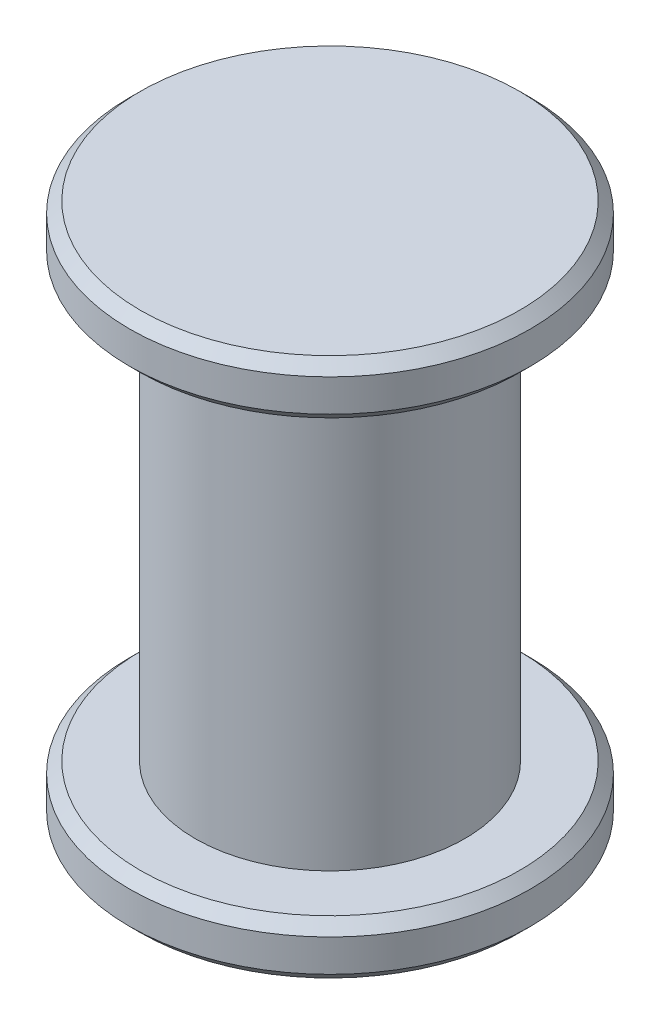
ISO-10303-21;
HEADER;
FILE_DESCRIPTION(('STEP AP214'),'2;1');
FILE_NAME('part.step','',(''),(''),'','','');
FILE_SCHEMA(('AUTOMOTIVE_DESIGN { 1 0 10303 214 1 1 1 1 }'));
ENDSEC;
DATA;
#1=APPLICATION_CONTEXT('core data for automotive mechanical design processes');
#2=APPLICATION_PROTOCOL_DEFINITION('international standard','automotive_design',2000,#1);
#3=PRODUCT_CONTEXT('',#1,'mechanical');
#4=PRODUCT('Part','Part','',(#3));
#5=PRODUCT_RELATED_PRODUCT_CATEGORY('part','',(#4));
#6=PRODUCT_DEFINITION_FORMATION('','',#4);
#7=PRODUCT_DEFINITION_CONTEXT('part definition',#1,'design');
#8=PRODUCT_DEFINITION('design','',#6,#7);
#9=PRODUCT_DEFINITION_SHAPE('','',#8);
#10=(LENGTH_UNIT() NAMED_UNIT(*) SI_UNIT(.MILLI.,.METRE.));
#11=(NAMED_UNIT(*) PLANE_ANGLE_UNIT() SI_UNIT($,.RADIAN.));
#12=(NAMED_UNIT(*) SI_UNIT($,.STERADIAN.) SOLID_ANGLE_UNIT());
#13=UNCERTAINTY_MEASURE_WITH_UNIT(LENGTH_MEASURE(1.E-05),#10,'distance_accuracy_value','');
#14=(GEOMETRIC_REPRESENTATION_CONTEXT(3) GLOBAL_UNCERTAINTY_ASSIGNED_CONTEXT((#13)) GLOBAL_UNIT_ASSIGNED_CONTEXT((#10,
#11,#12)) REPRESENTATION_CONTEXT('',''));
#15=CARTESIAN_POINT('',(0.,0.,0.));
#16=DIRECTION('',(0.,0.,1.));
#17=DIRECTION('',(1.,0.,0.));
#18=AXIS2_PLACEMENT_3D('',#15,#16,#17);
#19=CARTESIAN_POINT('',(0.,0.8,0.));
#20=DIRECTION('',(0.,-1.,0.));
#21=DIRECTION('',(0.,0.,-1.));
#22=AXIS2_PLACEMENT_3D('',#19,#20,#21);
#23=CYLINDRICAL_SURFACE('',#22,0.25);
#24=CARTESIAN_POINT('',(0.,0.8,0.));
#25=DIRECTION('',(0.,1.,0.));
#26=DIRECTION('',(0.,0.,1.));
#27=AXIS2_PLACEMENT_3D('',#24,#25,#26);
#28=CIRCLE('',#27,0.25);
#29=CARTESIAN_POINT('',(0.,0.8,0.25));
#30=VERTEX_POINT('',#29);
#31=EDGE_CURVE('E77',#30,#30,#28,.T.);
#32=ORIENTED_EDGE('',*,*,#31,.F.);
#33=EDGE_LOOP('',(#32));
#34=FACE_BOUND('',#33,.T.);
#35=CARTESIAN_POINT('',(0.,0.,0.));
#36=DIRECTION('',(0.,1.,0.));
#37=DIRECTION('',(0.,0.,1.));
#38=AXIS2_PLACEMENT_3D('',#35,#36,#37);
#39=CIRCLE('',#38,0.25);
#40=CARTESIAN_POINT('',(0.,0.,0.25));
#41=VERTEX_POINT('',#40);
#42=EDGE_CURVE('E78',#41,#41,#39,.T.);
#43=ORIENTED_EDGE('',*,*,#42,.T.);
#44=EDGE_LOOP('',(#43));
#45=FACE_BOUND('',#44,.T.);
#46=ADVANCED_FACE('F37',(#34,#45),#23,.T.);
#47=CARTESIAN_POINT('',(0.,0.9,0.));
#48=DIRECTION('',(0.,-1.,0.));
#49=DIRECTION('',(0.,0.,-1.));
#50=AXIS2_PLACEMENT_3D('',#47,#48,#49);
#51=CYLINDRICAL_SURFACE('',#50,0.371871199051348);
#52=CARTESIAN_POINT('',(0.,0.82,0.));
#53=DIRECTION('',(0.,1.,0.));
#54=DIRECTION('',(0.,0.,1.));
#55=AXIS2_PLACEMENT_3D('',#52,#53,#54);
#56=CIRCLE('',#55,0.371871199051348);
#57=CARTESIAN_POINT('',(0.,0.82,0.371871199051348));
#58=VERTEX_POINT('',#57);
#59=EDGE_CURVE('E55',#58,#58,#56,.T.);
#60=ORIENTED_EDGE('',*,*,#59,.T.);
#61=EDGE_LOOP('',(#60));
#62=FACE_BOUND('',#61,.T.);
#63=CARTESIAN_POINT('',(0.,0.88,0.));
#64=DIRECTION('',(0.,1.,0.));
#65=DIRECTION('',(0.,0.,1.));
#66=AXIS2_PLACEMENT_3D('',#63,#64,#65);
#67=CIRCLE('',#66,0.371871199051348);
#68=CARTESIAN_POINT('',(0.,0.88,0.371871199051348));
#69=VERTEX_POINT('',#68);
#70=EDGE_CURVE('E69',#69,#69,#67,.F.);
#71=ORIENTED_EDGE('',*,*,#70,.T.);
#72=EDGE_LOOP('',(#71));
#73=FACE_BOUND('',#72,.T.);
#74=ADVANCED_FACE('F90',(#62,#73),#51,.T.);
#75=CARTESIAN_POINT('',(0.,0.9,0.));
#76=DIRECTION('',(0.,1.,0.));
#77=DIRECTION('',(0.,0.,1.));
#78=AXIS2_PLACEMENT_3D('',#75,#76,#77);
#79=PLANE('',#78);
#80=CARTESIAN_POINT('',(0.,0.9,0.));
#81=DIRECTION('',(0.,1.,0.));
#82=DIRECTION('',(0.,0.,1.));
#83=AXIS2_PLACEMENT_3D('',#80,#81,#82);
#84=CIRCLE('',#83,0.351871199051348);
#85=CARTESIAN_POINT('',(0.,0.9,0.351871199051348));
#86=VERTEX_POINT('',#85);
#87=EDGE_CURVE('E73',#86,#86,#84,.T.);
#88=ORIENTED_EDGE('',*,*,#87,.T.);
#89=EDGE_LOOP('',(#88));
#90=FACE_BOUND('',#89,.T.);
#91=ADVANCED_FACE('F112',(#90),#79,.T.);
#92=CARTESIAN_POINT('',(0.,0.8,0.));
#93=DIRECTION('',(0.,1.,0.));
#94=DIRECTION('',(0.,0.,1.));
#95=AXIS2_PLACEMENT_3D('',#92,#93,#94);
#96=PLANE('',#95);
#97=CARTESIAN_POINT('',(0.,0.8,0.));
#98=DIRECTION('',(0.,1.,0.));
#99=DIRECTION('',(0.,0.,1.));
#100=AXIS2_PLACEMENT_3D('',#97,#98,#99);
#101=CIRCLE('',#100,0.351871199051348);
#102=CARTESIAN_POINT('',(0.,0.8,0.351871199051348));
#103=VERTEX_POINT('',#102);
#104=EDGE_CURVE('E50',#103,#103,#101,.F.);
#105=ORIENTED_EDGE('',*,*,#104,.T.);
#106=EDGE_LOOP('',(#105));
#107=FACE_BOUND('',#106,.T.);
#108=ORIENTED_EDGE('',*,*,#31,.T.);
#109=EDGE_LOOP('',(#108));
#110=FACE_BOUND('',#109,.T.);
#111=ADVANCED_FACE('F86',(#107,#110),#96,.F.);
#112=CARTESIAN_POINT('',(0.,-0.1,0.));
#113=DIRECTION('',(0.,1.,0.));
#114=DIRECTION('',(0.,0.,1.));
#115=AXIS2_PLACEMENT_3D('',#112,#113,#114);
#116=CYLINDRICAL_SURFACE('',#115,0.371871199051348);
#117=CARTESIAN_POINT('',(0.,-0.0799999999999998,0.));
#118=DIRECTION('',(0.,-1.,0.));
#119=DIRECTION('',(0.,0.,-1.));
#120=AXIS2_PLACEMENT_3D('',#117,#118,#119);
#121=CIRCLE('',#120,0.371871199051348);
#122=CARTESIAN_POINT('',(0.,-0.0799999999999998,-0.371871199051348));
#123=VERTEX_POINT('',#122);
#124=EDGE_CURVE('E10',#123,#123,#121,.F.);
#125=ORIENTED_EDGE('',*,*,#124,.T.);
#126=EDGE_LOOP('',(#125));
#127=FACE_BOUND('',#126,.T.);
#128=CARTESIAN_POINT('',(0.,-0.0200000000000002,0.));
#129=DIRECTION('',(0.,-1.,0.));
#130=DIRECTION('',(0.,0.,-1.));
#131=AXIS2_PLACEMENT_3D('',#128,#129,#130);
#132=CIRCLE('',#131,0.371871199051348);
#133=CARTESIAN_POINT('',(0.,-0.0200000000000002,-0.371871199051348));
#134=VERTEX_POINT('',#133);
#135=EDGE_CURVE('E65',#134,#134,#132,.T.);
#136=ORIENTED_EDGE('',*,*,#135,.T.);
#137=EDGE_LOOP('',(#136));
#138=FACE_BOUND('',#137,.T.);
#139=ADVANCED_FACE('F107',(#127,#138),#116,.T.);
#140=CARTESIAN_POINT('',(0.,-0.1,0.));
#141=DIRECTION('',(0.,-1.,0.));
#142=DIRECTION('',(0.,0.,-1.));
#143=AXIS2_PLACEMENT_3D('',#140,#141,#142);
#144=PLANE('',#143);
#145=CARTESIAN_POINT('',(0.,-0.1,0.));
#146=DIRECTION('',(0.,-1.,0.));
#147=DIRECTION('',(0.,0.,-1.));
#148=AXIS2_PLACEMENT_3D('',#145,#146,#147);
#149=CIRCLE('',#148,0.351871199051348);
#150=CARTESIAN_POINT('',(0.,-0.1,-0.351871199051348));
#151=VERTEX_POINT('',#150);
#152=EDGE_CURVE('E45',#151,#151,#149,.T.);
#153=ORIENTED_EDGE('',*,*,#152,.T.);
#154=EDGE_LOOP('',(#153));
#155=FACE_BOUND('',#154,.T.);
#156=ADVANCED_FACE('F97',(#155),#144,.T.);
#157=CARTESIAN_POINT('',(0.,0.,0.));
#158=DIRECTION('',(0.,-1.,0.));
#159=DIRECTION('',(0.,0.,-1.));
#160=AXIS2_PLACEMENT_3D('',#157,#158,#159);
#161=PLANE('',#160);
#162=CARTESIAN_POINT('',(0.,0.,0.));
#163=DIRECTION('',(0.,-1.,0.));
#164=DIRECTION('',(0.,0.,-1.));
#165=AXIS2_PLACEMENT_3D('',#162,#163,#164);
#166=CIRCLE('',#165,0.351871199051348);
#167=CARTESIAN_POINT('',(0.,0.,-0.351871199051348));
#168=VERTEX_POINT('',#167);
#169=EDGE_CURVE('E61',#168,#168,#166,.F.);
#170=ORIENTED_EDGE('',*,*,#169,.T.);
#171=EDGE_LOOP('',(#170));
#172=FACE_BOUND('',#171,.T.);
#173=ORIENTED_EDGE('',*,*,#42,.F.);
#174=EDGE_LOOP('',(#173));
#175=FACE_BOUND('',#174,.T.);
#176=ADVANCED_FACE('F94',(#172,#175),#161,.F.);
#177=CARTESIAN_POINT('',(0.,0.9,0.));
#178=DIRECTION('',(0.,-1.,0.));
#179=DIRECTION('',(0.,0.,-1.));
#180=AXIS2_PLACEMENT_3D('',#177,#178,#179);
#181=CONICAL_SURFACE('',#180,0.351871199051348,0.785398163397444);
#182=ORIENTED_EDGE('',*,*,#70,.F.);
#183=EDGE_LOOP('',(#182));
#184=FACE_BOUND('',#183,.T.);
#185=ORIENTED_EDGE('',*,*,#87,.F.);
#186=EDGE_LOOP('',(#185));
#187=FACE_BOUND('',#186,.T.);
#188=ADVANCED_FACE('F96',(#184,#187),#181,.T.);
#189=CARTESIAN_POINT('',(0.,-0.0200000000000002,0.));
#190=DIRECTION('',(0.,-1.,0.));
#191=DIRECTION('',(0.,0.,-1.));
#192=AXIS2_PLACEMENT_3D('',#189,#190,#191);
#193=CONICAL_SURFACE('',#192,0.371871199051348,0.785398163397454);
#194=ORIENTED_EDGE('',*,*,#169,.F.);
#195=EDGE_LOOP('',(#194));
#196=FACE_BOUND('',#195,.T.);
#197=ORIENTED_EDGE('',*,*,#135,.F.);
#198=EDGE_LOOP('',(#197));
#199=FACE_BOUND('',#198,.T.);
#200=ADVANCED_FACE('F104',(#196,#199),#193,.T.);
#201=CARTESIAN_POINT('',(0.,0.82,0.));
#202=DIRECTION('',(0.,1.,0.));
#203=DIRECTION('',(0.,0.,1.));
#204=AXIS2_PLACEMENT_3D('',#201,#202,#203);
#205=CONICAL_SURFACE('',#204,0.371871199051348,0.785398163397452);
#206=ORIENTED_EDGE('',*,*,#104,.F.);
#207=EDGE_LOOP('',(#206));
#208=FACE_BOUND('',#207,.T.);
#209=ORIENTED_EDGE('',*,*,#59,.F.);
#210=EDGE_LOOP('',(#209));
#211=FACE_BOUND('',#210,.T.);
#212=ADVANCED_FACE('F123',(#208,#211),#205,.T.);
#213=CARTESIAN_POINT('',(0.,-0.1,0.));
#214=DIRECTION('',(0.,1.,0.));
#215=DIRECTION('',(0.,0.,1.));
#216=AXIS2_PLACEMENT_3D('',#213,#214,#215);
#217=CONICAL_SURFACE('',#216,0.351871199051348,0.785398163397447);
#218=ORIENTED_EDGE('',*,*,#124,.F.);
#219=EDGE_LOOP('',(#218));
#220=FACE_BOUND('',#219,.T.);
#221=ORIENTED_EDGE('',*,*,#152,.F.);
#222=EDGE_LOOP('',(#221));
#223=FACE_BOUND('',#222,.T.);
#224=ADVANCED_FACE('F39',(#220,#223),#217,.T.);
#225=CLOSED_SHELL('',(#46,#74,#91,#111,#139,#156,#176,#188,#200,#212,#224));
#226=MANIFOLD_SOLID_BREP('B2',#225);
#227=ADVANCED_BREP_SHAPE_REPRESENTATION('',(#18,#226),#14);
#228=SHAPE_DEFINITION_REPRESENTATION(#9,#227);
ENDSEC;
END-ISO-10303-21;
